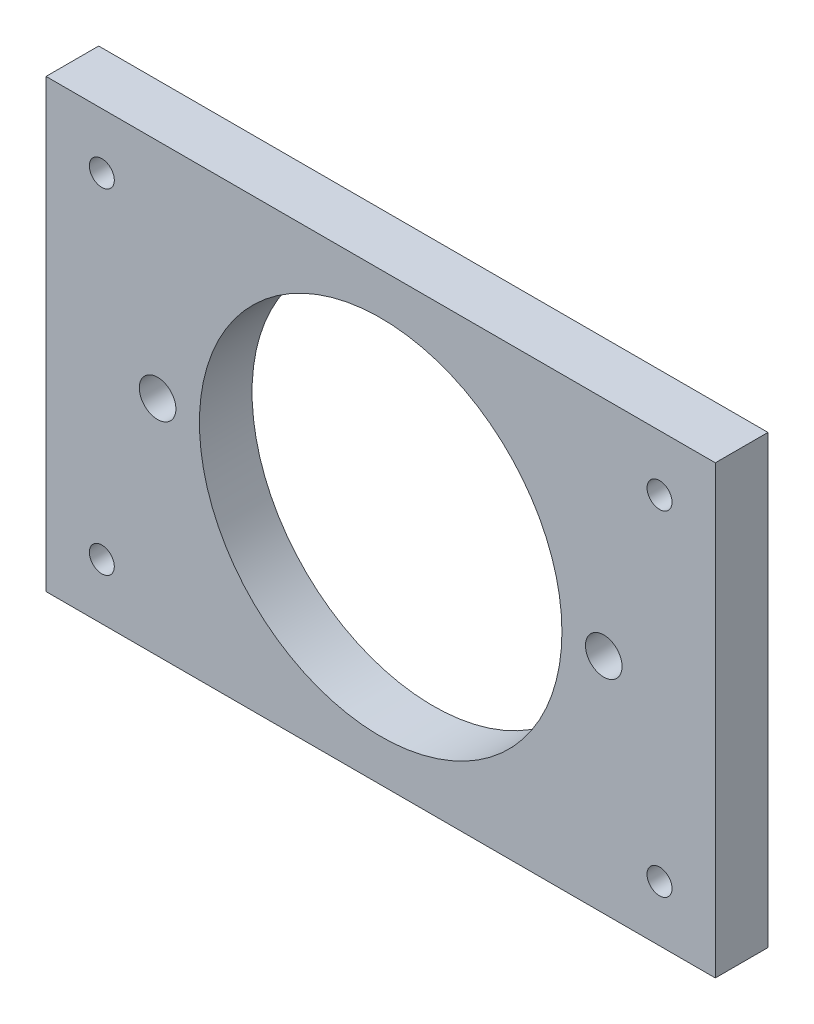
ISO-10303-21;
HEADER;
FILE_DESCRIPTION(('STEP AP214'),'2;1');
FILE_NAME('part.step','',(''),(''),'','','');
FILE_SCHEMA(('AUTOMOTIVE_DESIGN { 1 0 10303 214 1 1 1 1 }'));
ENDSEC;
DATA;
#1=APPLICATION_CONTEXT('core data for automotive mechanical design processes');
#2=APPLICATION_PROTOCOL_DEFINITION('international standard','automotive_design',2000,#1);
#3=PRODUCT_CONTEXT('',#1,'mechanical');
#4=PRODUCT('Part','Part','',(#3));
#5=PRODUCT_RELATED_PRODUCT_CATEGORY('part','',(#4));
#6=PRODUCT_DEFINITION_FORMATION('','',#4);
#7=PRODUCT_DEFINITION_CONTEXT('part definition',#1,'design');
#8=PRODUCT_DEFINITION('design','',#6,#7);
#9=PRODUCT_DEFINITION_SHAPE('','',#8);
#10=(LENGTH_UNIT() NAMED_UNIT(*) SI_UNIT(.MILLI.,.METRE.));
#11=(NAMED_UNIT(*) PLANE_ANGLE_UNIT() SI_UNIT($,.RADIAN.));
#12=(NAMED_UNIT(*) SI_UNIT($,.STERADIAN.) SOLID_ANGLE_UNIT());
#13=UNCERTAINTY_MEASURE_WITH_UNIT(LENGTH_MEASURE(1.E-05),#10,'distance_accuracy_value','');
#14=(GEOMETRIC_REPRESENTATION_CONTEXT(3) GLOBAL_UNCERTAINTY_ASSIGNED_CONTEXT((#13)) GLOBAL_UNIT_ASSIGNED_CONTEXT((#10,
#11,#12)) REPRESENTATION_CONTEXT('',''));
#15=CARTESIAN_POINT('',(0.,0.,0.));
#16=DIRECTION('',(0.,0.,1.));
#17=DIRECTION('',(1.,0.,0.));
#18=AXIS2_PLACEMENT_3D('',#15,#16,#17);
#19=CARTESIAN_POINT('',(0.,0.,5.9944));
#20=DIRECTION('',(0.,0.,1.));
#21=DIRECTION('',(1.,0.,0.));
#22=AXIS2_PLACEMENT_3D('',#19,#20,#21);
#23=PLANE('',#22);
#24=CARTESIAN_POINT('',(31.75,-19.05,5.9944));
#25=DIRECTION('',(0.,0.,1.));
#26=DIRECTION('',(1.,0.,0.));
#27=AXIS2_PLACEMENT_3D('',#24,#25,#26);
#28=CIRCLE('',#27,1.4224);
#29=CARTESIAN_POINT('',(33.1724,-19.05,5.9944));
#30=VERTEX_POINT('',#29);
#31=EDGE_CURVE('E139',#30,#30,#28,.T.);
#32=ORIENTED_EDGE('',*,*,#31,.F.);
#33=EDGE_LOOP('',(#32));
#34=FACE_BOUND('',#33,.T.);
#35=CARTESIAN_POINT('',(-31.75,19.05,5.9944));
#36=DIRECTION('',(0.,0.,1.));
#37=DIRECTION('',(1.,0.,0.));
#38=AXIS2_PLACEMENT_3D('',#35,#36,#37);
#39=CIRCLE('',#38,1.42239999999999);
#40=CARTESIAN_POINT('',(-30.3276,19.05,5.9944));
#41=VERTEX_POINT('',#40);
#42=EDGE_CURVE('E127',#41,#41,#39,.T.);
#43=ORIENTED_EDGE('',*,*,#42,.F.);
#44=EDGE_LOOP('',(#43));
#45=FACE_BOUND('',#44,.T.);
#46=CARTESIAN_POINT('',(-25.4,0.,5.9944));
#47=DIRECTION('',(0.,0.,1.));
#48=DIRECTION('',(1.,0.,0.));
#49=AXIS2_PLACEMENT_3D('',#46,#47,#48);
#50=CIRCLE('',#49,2.0828);
#51=CARTESIAN_POINT('',(-23.3172,0.,5.9944));
#52=VERTEX_POINT('',#51);
#53=EDGE_CURVE('E115',#52,#52,#50,.T.);
#54=ORIENTED_EDGE('',*,*,#53,.F.);
#55=EDGE_LOOP('',(#54));
#56=FACE_BOUND('',#55,.T.);
#57=DIRECTION('',(0.,-1.,0.));
#58=VECTOR('',#57,1.);
#59=CARTESIAN_POINT('',(-38.1,25.4,5.9944));
#60=LINE('',#59,#58);
#61=CARTESIAN_POINT('',(-38.1,25.4,5.9944));
#62=VERTEX_POINT('',#61);
#63=CARTESIAN_POINT('',(-38.1,-25.4,5.9944));
#64=VERTEX_POINT('',#63);
#65=EDGE_CURVE('E85',#62,#64,#60,.T.);
#66=ORIENTED_EDGE('',*,*,#65,.T.);
#67=DIRECTION('',(1.,0.,0.));
#68=VECTOR('',#67,1.);
#69=CARTESIAN_POINT('',(-38.1,-25.4,5.9944));
#70=LINE('',#69,#68);
#71=CARTESIAN_POINT('',(38.1,-25.4,5.9944));
#72=VERTEX_POINT('',#71);
#73=EDGE_CURVE('E80',#64,#72,#70,.T.);
#74=ORIENTED_EDGE('',*,*,#73,.T.);
#75=DIRECTION('',(0.,1.,0.));
#76=VECTOR('',#75,1.);
#77=CARTESIAN_POINT('',(38.1,25.4,5.9944));
#78=LINE('',#77,#76);
#79=CARTESIAN_POINT('',(38.1,25.4,5.9944));
#80=VERTEX_POINT('',#79);
#81=EDGE_CURVE('E83',#72,#80,#78,.T.);
#82=ORIENTED_EDGE('',*,*,#81,.T.);
#83=DIRECTION('',(-1.,0.,0.));
#84=VECTOR('',#83,1.);
#85=CARTESIAN_POINT('',(-38.1,25.4,5.9944));
#86=LINE('',#85,#84);
#87=EDGE_CURVE('E50',#80,#62,#86,.T.);
#88=ORIENTED_EDGE('',*,*,#87,.T.);
#89=EDGE_LOOP('',(#66,#74,#82,#88));
#90=FACE_BOUND('',#89,.T.);
#91=CARTESIAN_POINT('',(0.,0.,5.9944));
#92=DIRECTION('',(0.,0.,1.));
#93=DIRECTION('',(1.,0.,0.));
#94=AXIS2_PLACEMENT_3D('',#91,#92,#93);
#95=CIRCLE('',#94,20.6375);
#96=CARTESIAN_POINT('',(20.6375,0.,5.9944));
#97=VERTEX_POINT('',#96);
#98=EDGE_CURVE('E100',#97,#97,#95,.T.);
#99=ORIENTED_EDGE('',*,*,#98,.F.);
#100=EDGE_LOOP('',(#99));
#101=FACE_BOUND('',#100,.T.);
#102=CARTESIAN_POINT('',(25.4,0.,5.9944));
#103=DIRECTION('',(0.,0.,1.));
#104=DIRECTION('',(1.,0.,0.));
#105=AXIS2_PLACEMENT_3D('',#102,#103,#104);
#106=CIRCLE('',#105,2.0828);
#107=CARTESIAN_POINT('',(27.4828,0.,5.9944));
#108=VERTEX_POINT('',#107);
#109=EDGE_CURVE('E121',#108,#108,#106,.T.);
#110=ORIENTED_EDGE('',*,*,#109,.F.);
#111=EDGE_LOOP('',(#110));
#112=FACE_BOUND('',#111,.T.);
#113=CARTESIAN_POINT('',(-31.75,-19.05,5.9944));
#114=DIRECTION('',(0.,0.,1.));
#115=DIRECTION('',(1.,0.,0.));
#116=AXIS2_PLACEMENT_3D('',#113,#114,#115);
#117=CIRCLE('',#116,1.42239999999999);
#118=CARTESIAN_POINT('',(-30.3276,-19.05,5.9944));
#119=VERTEX_POINT('',#118);
#120=EDGE_CURVE('E133',#119,#119,#117,.T.);
#121=ORIENTED_EDGE('',*,*,#120,.F.);
#122=EDGE_LOOP('',(#121));
#123=FACE_BOUND('',#122,.T.);
#124=CARTESIAN_POINT('',(31.75,19.05,5.9944));
#125=DIRECTION('',(0.,0.,1.));
#126=DIRECTION('',(1.,0.,0.));
#127=AXIS2_PLACEMENT_3D('',#124,#125,#126);
#128=CIRCLE('',#127,1.4224);
#129=CARTESIAN_POINT('',(33.1724,19.05,5.9944));
#130=VERTEX_POINT('',#129);
#131=EDGE_CURVE('E145',#130,#130,#128,.T.);
#132=ORIENTED_EDGE('',*,*,#131,.F.);
#133=EDGE_LOOP('',(#132));
#134=FACE_BOUND('',#133,.T.);
#135=ADVANCED_FACE('F33',(#34,#45,#56,#90,#101,#112,#123,#134),#23,.T.);
#136=CARTESIAN_POINT('',(0.,0.,0.));
#137=DIRECTION('',(0.,0.,1.));
#138=DIRECTION('',(1.,0.,0.));
#139=AXIS2_PLACEMENT_3D('',#136,#137,#138);
#140=PLANE('',#139);
#141=CARTESIAN_POINT('',(31.75,-19.05,0.));
#142=DIRECTION('',(0.,0.,1.));
#143=DIRECTION('',(1.,0.,0.));
#144=AXIS2_PLACEMENT_3D('',#141,#142,#143);
#145=CIRCLE('',#144,1.4224);
#146=CARTESIAN_POINT('',(33.1724,-19.05,0.));
#147=VERTEX_POINT('',#146);
#148=EDGE_CURVE('E142',#147,#147,#145,.T.);
#149=ORIENTED_EDGE('',*,*,#148,.T.);
#150=EDGE_LOOP('',(#149));
#151=FACE_BOUND('',#150,.T.);
#152=CARTESIAN_POINT('',(-31.75,19.05,0.));
#153=DIRECTION('',(0.,0.,1.));
#154=DIRECTION('',(1.,0.,0.));
#155=AXIS2_PLACEMENT_3D('',#152,#153,#154);
#156=CIRCLE('',#155,1.42239999999999);
#157=CARTESIAN_POINT('',(-30.3276,19.05,0.));
#158=VERTEX_POINT('',#157);
#159=EDGE_CURVE('E130',#158,#158,#156,.T.);
#160=ORIENTED_EDGE('',*,*,#159,.T.);
#161=EDGE_LOOP('',(#160));
#162=FACE_BOUND('',#161,.T.);
#163=CARTESIAN_POINT('',(-25.4,0.,0.));
#164=DIRECTION('',(0.,0.,1.));
#165=DIRECTION('',(1.,0.,0.));
#166=AXIS2_PLACEMENT_3D('',#163,#164,#165);
#167=CIRCLE('',#166,2.0828);
#168=CARTESIAN_POINT('',(-23.3172,0.,0.));
#169=VERTEX_POINT('',#168);
#170=EDGE_CURVE('E118',#169,#169,#167,.T.);
#171=ORIENTED_EDGE('',*,*,#170,.T.);
#172=EDGE_LOOP('',(#171));
#173=FACE_BOUND('',#172,.T.);
#174=DIRECTION('',(0.,-1.,0.));
#175=VECTOR('',#174,1.);
#176=CARTESIAN_POINT('',(-38.1,25.4,0.));
#177=LINE('',#176,#175);
#178=CARTESIAN_POINT('',(-38.1,25.4,0.));
#179=VERTEX_POINT('',#178);
#180=CARTESIAN_POINT('',(-38.1,-25.4,0.));
#181=VERTEX_POINT('',#180);
#182=EDGE_CURVE('E97',#179,#181,#177,.T.);
#183=ORIENTED_EDGE('',*,*,#182,.F.);
#184=DIRECTION('',(-1.,0.,0.));
#185=VECTOR('',#184,1.);
#186=CARTESIAN_POINT('',(-38.1,25.4,0.));
#187=LINE('',#186,#185);
#188=CARTESIAN_POINT('',(38.1,25.4,0.));
#189=VERTEX_POINT('',#188);
#190=EDGE_CURVE('E73',#189,#179,#187,.T.);
#191=ORIENTED_EDGE('',*,*,#190,.F.);
#192=DIRECTION('',(0.,1.,0.));
#193=VECTOR('',#192,1.);
#194=CARTESIAN_POINT('',(38.1,25.4,0.));
#195=LINE('',#194,#193);
#196=CARTESIAN_POINT('',(38.1,-25.4,0.));
#197=VERTEX_POINT('',#196);
#198=EDGE_CURVE('E67',#197,#189,#195,.T.);
#199=ORIENTED_EDGE('',*,*,#198,.F.);
#200=DIRECTION('',(1.,0.,0.));
#201=VECTOR('',#200,1.);
#202=CARTESIAN_POINT('',(-38.1,-25.4,0.));
#203=LINE('',#202,#201);
#204=EDGE_CURVE('E89',#181,#197,#203,.T.);
#205=ORIENTED_EDGE('',*,*,#204,.F.);
#206=EDGE_LOOP('',(#183,#191,#199,#205));
#207=FACE_BOUND('',#206,.T.);
#208=CARTESIAN_POINT('',(0.,0.,0.));
#209=DIRECTION('',(0.,0.,1.));
#210=DIRECTION('',(1.,0.,0.));
#211=AXIS2_PLACEMENT_3D('',#208,#209,#210);
#212=CIRCLE('',#211,20.6375);
#213=CARTESIAN_POINT('',(20.6375,0.,0.));
#214=VERTEX_POINT('',#213);
#215=EDGE_CURVE('E112',#214,#214,#212,.T.);
#216=ORIENTED_EDGE('',*,*,#215,.T.);
#217=EDGE_LOOP('',(#216));
#218=FACE_BOUND('',#217,.T.);
#219=CARTESIAN_POINT('',(25.4,0.,0.));
#220=DIRECTION('',(0.,0.,1.));
#221=DIRECTION('',(1.,0.,0.));
#222=AXIS2_PLACEMENT_3D('',#219,#220,#221);
#223=CIRCLE('',#222,2.0828);
#224=CARTESIAN_POINT('',(27.4828,0.,0.));
#225=VERTEX_POINT('',#224);
#226=EDGE_CURVE('E124',#225,#225,#223,.T.);
#227=ORIENTED_EDGE('',*,*,#226,.T.);
#228=EDGE_LOOP('',(#227));
#229=FACE_BOUND('',#228,.T.);
#230=CARTESIAN_POINT('',(-31.75,-19.05,0.));
#231=DIRECTION('',(0.,0.,1.));
#232=DIRECTION('',(1.,0.,0.));
#233=AXIS2_PLACEMENT_3D('',#230,#231,#232);
#234=CIRCLE('',#233,1.42239999999999);
#235=CARTESIAN_POINT('',(-30.3276,-19.05,0.));
#236=VERTEX_POINT('',#235);
#237=EDGE_CURVE('E136',#236,#236,#234,.T.);
#238=ORIENTED_EDGE('',*,*,#237,.T.);
#239=EDGE_LOOP('',(#238));
#240=FACE_BOUND('',#239,.T.);
#241=CARTESIAN_POINT('',(31.75,19.05,0.));
#242=DIRECTION('',(0.,0.,1.));
#243=DIRECTION('',(1.,0.,0.));
#244=AXIS2_PLACEMENT_3D('',#241,#242,#243);
#245=CIRCLE('',#244,1.4224);
#246=CARTESIAN_POINT('',(33.1724,19.05,0.));
#247=VERTEX_POINT('',#246);
#248=EDGE_CURVE('E148',#247,#247,#245,.T.);
#249=ORIENTED_EDGE('',*,*,#248,.T.);
#250=EDGE_LOOP('',(#249));
#251=FACE_BOUND('',#250,.T.);
#252=ADVANCED_FACE('F108',(#151,#162,#173,#207,#218,#229,#240,#251),#140,.F.);
#253=CARTESIAN_POINT('',(-38.1,25.4,5.9944));
#254=DIRECTION('',(1.,0.,0.));
#255=DIRECTION('',(0.,1.,0.));
#256=AXIS2_PLACEMENT_3D('',#253,#254,#255);
#257=PLANE('',#256);
#258=ORIENTED_EDGE('',*,*,#182,.T.);
#259=DIRECTION('',(0.,0.,-1.));
#260=VECTOR('',#259,1.);
#261=CARTESIAN_POINT('',(-38.1,-25.4,5.9944));
#262=LINE('',#261,#260);
#263=EDGE_CURVE('E11',#64,#181,#262,.T.);
#264=ORIENTED_EDGE('',*,*,#263,.F.);
#265=ORIENTED_EDGE('',*,*,#65,.F.);
#266=DIRECTION('',(0.,0.,-1.));
#267=VECTOR('',#266,1.);
#268=CARTESIAN_POINT('',(-38.1,25.4,5.9944));
#269=LINE('',#268,#267);
#270=EDGE_CURVE('E93',#62,#179,#269,.T.);
#271=ORIENTED_EDGE('',*,*,#270,.T.);
#272=EDGE_LOOP('',(#258,#264,#265,#271));
#273=FACE_BOUND('',#272,.T.);
#274=ADVANCED_FACE('F35',(#273),#257,.F.);
#275=CARTESIAN_POINT('',(-38.1,-25.4,5.9944));
#276=DIRECTION('',(0.,1.,0.));
#277=DIRECTION('',(0.,0.,1.));
#278=AXIS2_PLACEMENT_3D('',#275,#276,#277);
#279=PLANE('',#278);
#280=ORIENTED_EDGE('',*,*,#204,.T.);
#281=DIRECTION('',(0.,0.,-1.));
#282=VECTOR('',#281,1.);
#283=CARTESIAN_POINT('',(38.1,-25.4,5.9944));
#284=LINE('',#283,#282);
#285=EDGE_CURVE('E42',#72,#197,#284,.T.);
#286=ORIENTED_EDGE('',*,*,#285,.F.);
#287=ORIENTED_EDGE('',*,*,#73,.F.);
#288=ORIENTED_EDGE('',*,*,#263,.T.);
#289=EDGE_LOOP('',(#280,#286,#287,#288));
#290=FACE_BOUND('',#289,.T.);
#291=ADVANCED_FACE('F88',(#290),#279,.F.);
#292=CARTESIAN_POINT('',(38.1,25.4,5.9944));
#293=DIRECTION('',(-1.,0.,0.));
#294=DIRECTION('',(0.,-1.,0.));
#295=AXIS2_PLACEMENT_3D('',#292,#293,#294);
#296=PLANE('',#295);
#297=ORIENTED_EDGE('',*,*,#198,.T.);
#298=DIRECTION('',(0.,0.,-1.));
#299=VECTOR('',#298,1.);
#300=CARTESIAN_POINT('',(38.1,25.4,5.9944));
#301=LINE('',#300,#299);
#302=EDGE_CURVE('E90',#80,#189,#301,.T.);
#303=ORIENTED_EDGE('',*,*,#302,.F.);
#304=ORIENTED_EDGE('',*,*,#81,.F.);
#305=ORIENTED_EDGE('',*,*,#285,.T.);
#306=EDGE_LOOP('',(#297,#303,#304,#305));
#307=FACE_BOUND('',#306,.T.);
#308=ADVANCED_FACE('F91',(#307),#296,.F.);
#309=CARTESIAN_POINT('',(-38.1,25.4,5.9944));
#310=DIRECTION('',(0.,-1.,0.));
#311=DIRECTION('',(0.,0.,-1.));
#312=AXIS2_PLACEMENT_3D('',#309,#310,#311);
#313=PLANE('',#312);
#314=ORIENTED_EDGE('',*,*,#190,.T.);
#315=ORIENTED_EDGE('',*,*,#270,.F.);
#316=ORIENTED_EDGE('',*,*,#87,.F.);
#317=ORIENTED_EDGE('',*,*,#302,.T.);
#318=EDGE_LOOP('',(#314,#315,#316,#317));
#319=FACE_BOUND('',#318,.T.);
#320=ADVANCED_FACE('F105',(#319),#313,.F.);
#321=CARTESIAN_POINT('',(0.,0.,5.9944));
#322=DIRECTION('',(0.,0.,-1.));
#323=DIRECTION('',(-1.,0.,0.));
#324=AXIS2_PLACEMENT_3D('',#321,#322,#323);
#325=CYLINDRICAL_SURFACE('',#324,20.6375);
#326=ORIENTED_EDGE('',*,*,#98,.T.);
#327=EDGE_LOOP('',(#326));
#328=FACE_BOUND('',#327,.T.);
#329=ORIENTED_EDGE('',*,*,#215,.F.);
#330=EDGE_LOOP('',(#329));
#331=FACE_BOUND('',#330,.T.);
#332=ADVANCED_FACE('F168',(#328,#331),#325,.F.);
#333=CARTESIAN_POINT('',(-25.4,0.,5.9944));
#334=DIRECTION('',(0.,0.,-1.));
#335=DIRECTION('',(-1.,0.,0.));
#336=AXIS2_PLACEMENT_3D('',#333,#334,#335);
#337=CYLINDRICAL_SURFACE('',#336,2.0828);
#338=ORIENTED_EDGE('',*,*,#53,.T.);
#339=EDGE_LOOP('',(#338));
#340=FACE_BOUND('',#339,.T.);
#341=ORIENTED_EDGE('',*,*,#170,.F.);
#342=EDGE_LOOP('',(#341));
#343=FACE_BOUND('',#342,.T.);
#344=ADVANCED_FACE('F214',(#340,#343),#337,.F.);
#345=CARTESIAN_POINT('',(25.4,0.,5.9944));
#346=DIRECTION('',(0.,0.,-1.));
#347=DIRECTION('',(-1.,0.,0.));
#348=AXIS2_PLACEMENT_3D('',#345,#346,#347);
#349=CYLINDRICAL_SURFACE('',#348,2.0828);
#350=ORIENTED_EDGE('',*,*,#109,.T.);
#351=EDGE_LOOP('',(#350));
#352=FACE_BOUND('',#351,.T.);
#353=ORIENTED_EDGE('',*,*,#226,.F.);
#354=EDGE_LOOP('',(#353));
#355=FACE_BOUND('',#354,.T.);
#356=ADVANCED_FACE('F222',(#352,#355),#349,.F.);
#357=CARTESIAN_POINT('',(-31.75,19.05,5.9944));
#358=DIRECTION('',(0.,0.,-1.));
#359=DIRECTION('',(-1.,0.,0.));
#360=AXIS2_PLACEMENT_3D('',#357,#358,#359);
#361=CYLINDRICAL_SURFACE('',#360,1.42239999999999);
#362=ORIENTED_EDGE('',*,*,#42,.T.);
#363=EDGE_LOOP('',(#362));
#364=FACE_BOUND('',#363,.T.);
#365=ORIENTED_EDGE('',*,*,#159,.F.);
#366=EDGE_LOOP('',(#365));
#367=FACE_BOUND('',#366,.T.);
#368=ADVANCED_FACE('F230',(#364,#367),#361,.F.);
#369=CARTESIAN_POINT('',(-31.75,-19.05,5.9944));
#370=DIRECTION('',(0.,0.,-1.));
#371=DIRECTION('',(-1.,0.,0.));
#372=AXIS2_PLACEMENT_3D('',#369,#370,#371);
#373=CYLINDRICAL_SURFACE('',#372,1.42239999999999);
#374=ORIENTED_EDGE('',*,*,#120,.T.);
#375=EDGE_LOOP('',(#374));
#376=FACE_BOUND('',#375,.T.);
#377=ORIENTED_EDGE('',*,*,#237,.F.);
#378=EDGE_LOOP('',(#377));
#379=FACE_BOUND('',#378,.T.);
#380=ADVANCED_FACE('F239',(#376,#379),#373,.F.);
#381=CARTESIAN_POINT('',(31.75,-19.05,5.9944));
#382=DIRECTION('',(0.,0.,-1.));
#383=DIRECTION('',(-1.,0.,0.));
#384=AXIS2_PLACEMENT_3D('',#381,#382,#383);
#385=CYLINDRICAL_SURFACE('',#384,1.4224);
#386=ORIENTED_EDGE('',*,*,#31,.T.);
#387=EDGE_LOOP('',(#386));
#388=FACE_BOUND('',#387,.T.);
#389=ORIENTED_EDGE('',*,*,#148,.F.);
#390=EDGE_LOOP('',(#389));
#391=FACE_BOUND('',#390,.T.);
#392=ADVANCED_FACE('F248',(#388,#391),#385,.F.);
#393=CARTESIAN_POINT('',(31.75,19.05,5.9944));
#394=DIRECTION('',(0.,0.,-1.));
#395=DIRECTION('',(-1.,0.,0.));
#396=AXIS2_PLACEMENT_3D('',#393,#394,#395);
#397=CYLINDRICAL_SURFACE('',#396,1.4224);
#398=ORIENTED_EDGE('',*,*,#131,.T.);
#399=EDGE_LOOP('',(#398));
#400=FACE_BOUND('',#399,.T.);
#401=ORIENTED_EDGE('',*,*,#248,.F.);
#402=EDGE_LOOP('',(#401));
#403=FACE_BOUND('',#402,.T.);
#404=ADVANCED_FACE('F154',(#400,#403),#397,.F.);
#405=CLOSED_SHELL('',(#135,#252,#274,#291,#308,#320,#332,#344,#356,#368,#380,#392,#404));
#406=MANIFOLD_SOLID_BREP('B2',#405);
#407=ADVANCED_BREP_SHAPE_REPRESENTATION('',(#18,#406),#14);
#408=SHAPE_DEFINITION_REPRESENTATION(#9,#407);
ENDSEC;
END-ISO-10303-21;
